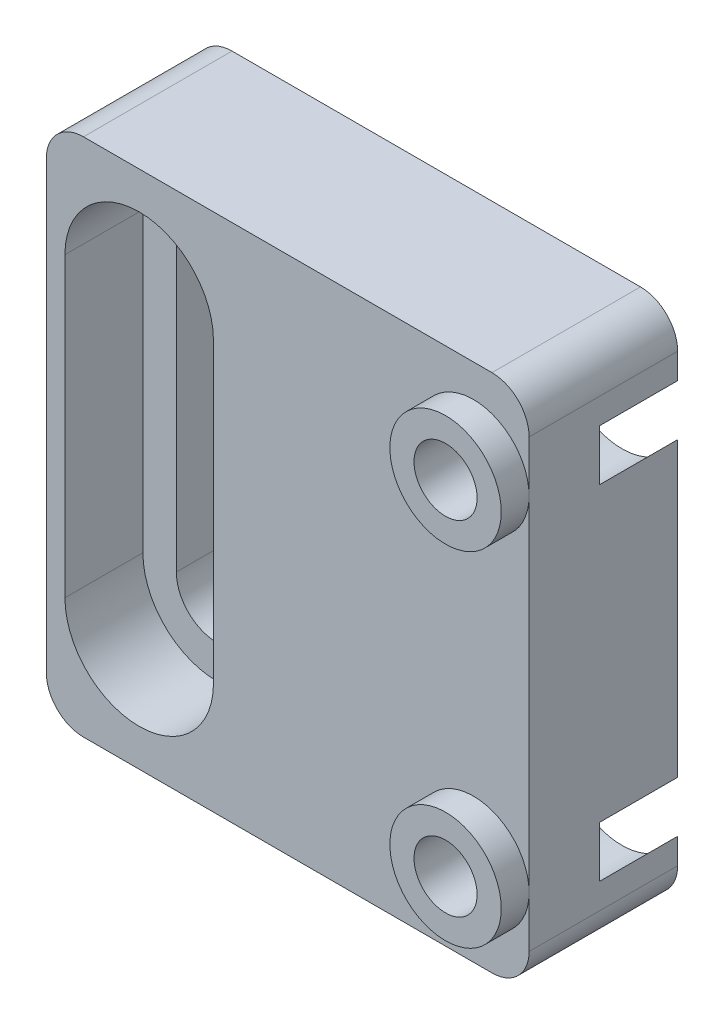
ISO-10303-21;
HEADER;
FILE_DESCRIPTION(('STEP AP214'),'2;1');
FILE_NAME('part.step','',(''),(''),'','','');
FILE_SCHEMA(('AUTOMOTIVE_DESIGN { 1 0 10303 214 1 1 1 1 }'));
ENDSEC;
DATA;
#1=APPLICATION_CONTEXT('core data for automotive mechanical design processes');
#2=APPLICATION_PROTOCOL_DEFINITION('international standard','automotive_design',2000,#1);
#3=PRODUCT_CONTEXT('',#1,'mechanical');
#4=PRODUCT('Part','Part','',(#3));
#5=PRODUCT_RELATED_PRODUCT_CATEGORY('part','',(#4));
#6=PRODUCT_DEFINITION_FORMATION('','',#4);
#7=PRODUCT_DEFINITION_CONTEXT('part definition',#1,'design');
#8=PRODUCT_DEFINITION('design','',#6,#7);
#9=PRODUCT_DEFINITION_SHAPE('','',#8);
#10=(LENGTH_UNIT() NAMED_UNIT(*) SI_UNIT(.MILLI.,.METRE.));
#11=(NAMED_UNIT(*) PLANE_ANGLE_UNIT() SI_UNIT($,.RADIAN.));
#12=(NAMED_UNIT(*) SI_UNIT($,.STERADIAN.) SOLID_ANGLE_UNIT());
#13=UNCERTAINTY_MEASURE_WITH_UNIT(LENGTH_MEASURE(1.E-05),#10,'distance_accuracy_value','');
#14=(GEOMETRIC_REPRESENTATION_CONTEXT(3) GLOBAL_UNCERTAINTY_ASSIGNED_CONTEXT((#13)) GLOBAL_UNIT_ASSIGNED_CONTEXT((#10,
#11,#12)) REPRESENTATION_CONTEXT('',''));
#15=CARTESIAN_POINT('',(0.,0.,0.));
#16=DIRECTION('',(0.,0.,1.));
#17=DIRECTION('',(1.,0.,0.));
#18=AXIS2_PLACEMENT_3D('',#15,#16,#17);
#19=CARTESIAN_POINT('',(0.,0.,8.));
#20=DIRECTION('',(0.,0.,1.));
#21=DIRECTION('',(1.,0.,0.));
#22=AXIS2_PLACEMENT_3D('',#19,#20,#21);
#23=PLANE('',#22);
#24=CARTESIAN_POINT('',(-3.00000000000001,8.,8.));
#25=DIRECTION('',(0.,0.,1.));
#26=DIRECTION('',(1.,0.,0.));
#27=AXIS2_PLACEMENT_3D('',#24,#25,#26);
#28=CIRCLE('',#27,4.);
#29=CARTESIAN_POINT('',(0.999999999999994,8.,8.));
#30=VERTEX_POINT('',#29);
#31=CARTESIAN_POINT('',(-7.,8.,8.));
#32=VERTEX_POINT('',#31);
#33=EDGE_CURVE('E321',#30,#32,#28,.T.);
#34=ORIENTED_EDGE('',*,*,#33,.F.);
#35=DIRECTION('',(0.,1.,0.));
#36=VECTOR('',#35,1.);
#37=CARTESIAN_POINT('',(0.999999999999994,8.,8.));
#38=LINE('',#37,#36);
#39=CARTESIAN_POINT('',(0.999999999999999,-8.,8.));
#40=VERTEX_POINT('',#39);
#41=EDGE_CURVE('E311',#40,#30,#38,.T.);
#42=ORIENTED_EDGE('',*,*,#41,.F.);
#43=CARTESIAN_POINT('',(-3.,-8.,8.));
#44=DIRECTION('',(0.,0.,1.));
#45=DIRECTION('',(1.,0.,0.));
#46=AXIS2_PLACEMENT_3D('',#43,#44,#45);
#47=CIRCLE('',#46,4.);
#48=CARTESIAN_POINT('',(-7.,-8.,8.));
#49=VERTEX_POINT('',#48);
#50=EDGE_CURVE('E315',#49,#40,#47,.T.);
#51=ORIENTED_EDGE('',*,*,#50,.F.);
#52=DIRECTION('',(0.,-1.,0.));
#53=VECTOR('',#52,1.);
#54=CARTESIAN_POINT('',(-7.,8.,8.));
#55=LINE('',#54,#53);
#56=EDGE_CURVE('E318',#32,#49,#55,.T.);
#57=ORIENTED_EDGE('',*,*,#56,.F.);
#58=EDGE_LOOP('',(#34,#42,#51,#57));
#59=FACE_BOUND('',#58,.T.);
#60=DIRECTION('',(0.,-1.,0.));
#61=VECTOR('',#60,1.);
#62=CARTESIAN_POINT('',(-8.,14.,8.));
#63=LINE('',#62,#61);
#64=CARTESIAN_POINT('',(-8.,12.,8.));
#65=VERTEX_POINT('',#64);
#66=CARTESIAN_POINT('',(-8.,-12.,8.));
#67=VERTEX_POINT('',#66);
#68=EDGE_CURVE('E212',#65,#67,#63,.T.);
#69=ORIENTED_EDGE('',*,*,#68,.T.);
#70=CARTESIAN_POINT('',(-6.,-12.,8.));
#71=DIRECTION('',(0.,0.,1.));
#72=DIRECTION('',(1.,0.,0.));
#73=AXIS2_PLACEMENT_3D('',#70,#71,#72);
#74=CIRCLE('',#73,2.);
#75=CARTESIAN_POINT('',(-6.,-14.,8.));
#76=VERTEX_POINT('',#75);
#77=EDGE_CURVE('E243',#67,#76,#74,.T.);
#78=ORIENTED_EDGE('',*,*,#77,.T.);
#79=DIRECTION('',(1.,0.,0.));
#80=VECTOR('',#79,1.);
#81=CARTESIAN_POINT('',(-8.,-14.,8.));
#82=LINE('',#81,#80);
#83=CARTESIAN_POINT('',(16.,-14.,8.));
#84=VERTEX_POINT('',#83);
#85=EDGE_CURVE('E193',#76,#84,#82,.T.);
#86=ORIENTED_EDGE('',*,*,#85,.T.);
#87=CARTESIAN_POINT('',(16.,-12.,8.));
#88=DIRECTION('',(0.,0.,1.));
#89=DIRECTION('',(1.,0.,0.));
#90=AXIS2_PLACEMENT_3D('',#87,#88,#89);
#91=CIRCLE('',#90,2.);
#92=CARTESIAN_POINT('',(18.,-12.,8.));
#93=VERTEX_POINT('',#92);
#94=EDGE_CURVE('E48',#84,#93,#91,.T.);
#95=ORIENTED_EDGE('',*,*,#94,.T.);
#96=DIRECTION('',(0.,1.,0.));
#97=VECTOR('',#96,1.);
#98=CARTESIAN_POINT('',(18.,14.,8.));
#99=LINE('',#98,#97);
#100=CARTESIAN_POINT('',(18.,-9.25,8.));
#101=VERTEX_POINT('',#100);
#102=EDGE_CURVE('E177',#93,#101,#99,.T.);
#103=ORIENTED_EDGE('',*,*,#102,.T.);
#104=CARTESIAN_POINT('',(15.,-9.25,8.));
#105=DIRECTION('',(0.,0.,1.));
#106=DIRECTION('',(1.,0.,0.));
#107=AXIS2_PLACEMENT_3D('',#104,#105,#106);
#108=CIRCLE('',#107,3.);
#109=EDGE_CURVE('E182',#101,#101,#108,.T.);
#110=ORIENTED_EDGE('',*,*,#109,.F.);
#111=CARTESIAN_POINT('',(18.,9.25,8.));
#112=VERTEX_POINT('',#111);
#113=EDGE_CURVE('E186',#101,#112,#99,.T.);
#114=ORIENTED_EDGE('',*,*,#113,.T.);
#115=CARTESIAN_POINT('',(15.,9.25,8.));
#116=DIRECTION('',(0.,0.,1.));
#117=DIRECTION('',(1.,0.,0.));
#118=AXIS2_PLACEMENT_3D('',#115,#116,#117);
#119=CIRCLE('',#118,3.);
#120=EDGE_CURVE('E254',#112,#112,#119,.T.);
#121=ORIENTED_EDGE('',*,*,#120,.F.);
#122=CARTESIAN_POINT('',(18.,12.,8.));
#123=VERTEX_POINT('',#122);
#124=EDGE_CURVE('E188',#112,#123,#99,.T.);
#125=ORIENTED_EDGE('',*,*,#124,.T.);
#126=CARTESIAN_POINT('',(16.,12.,8.));
#127=DIRECTION('',(0.,0.,1.));
#128=DIRECTION('',(1.,0.,0.));
#129=AXIS2_PLACEMENT_3D('',#126,#127,#128);
#130=CIRCLE('',#129,2.);
#131=CARTESIAN_POINT('',(16.,14.,8.));
#132=VERTEX_POINT('',#131);
#133=EDGE_CURVE('E238',#123,#132,#130,.T.);
#134=ORIENTED_EDGE('',*,*,#133,.T.);
#135=DIRECTION('',(-1.,0.,0.));
#136=VECTOR('',#135,1.);
#137=CARTESIAN_POINT('',(-8.,14.,8.));
#138=LINE('',#137,#136);
#139=CARTESIAN_POINT('',(-6.,14.,8.));
#140=VERTEX_POINT('',#139);
#141=EDGE_CURVE('E185',#132,#140,#138,.T.);
#142=ORIENTED_EDGE('',*,*,#141,.T.);
#143=CARTESIAN_POINT('',(-6.,12.,8.));
#144=DIRECTION('',(0.,0.,1.));
#145=DIRECTION('',(1.,0.,0.));
#146=AXIS2_PLACEMENT_3D('',#143,#144,#145);
#147=CIRCLE('',#146,2.);
#148=EDGE_CURVE('E241',#140,#65,#147,.T.);
#149=ORIENTED_EDGE('',*,*,#148,.T.);
#150=EDGE_LOOP('',(#69,#78,#86,#95,#103,#110,#114,#121,#125,#134,#142,#149));
#151=FACE_BOUND('',#150,.T.);
#152=ADVANCED_FACE('F33',(#59,#151),#23,.T.);
#153=CARTESIAN_POINT('',(-3.,8.,0.));
#154=DIRECTION('',(0.,0.,1.));
#155=DIRECTION('',(1.,0.,0.));
#156=AXIS2_PLACEMENT_3D('',#153,#154,#155);
#157=CYLINDRICAL_SURFACE('',#156,2.2);
#158=CARTESIAN_POINT('',(-3.,8.,3.8));
#159=DIRECTION('',(0.,0.,1.));
#160=DIRECTION('',(1.,0.,0.));
#161=AXIS2_PLACEMENT_3D('',#158,#159,#160);
#162=CIRCLE('',#161,2.2);
#163=CARTESIAN_POINT('',(-5.2,8.,3.8));
#164=VERTEX_POINT('',#163);
#165=CARTESIAN_POINT('',(-0.800000000000004,8.,3.8));
#166=VERTEX_POINT('',#165);
#167=EDGE_CURVE('E295',#164,#166,#162,.F.);
#168=ORIENTED_EDGE('',*,*,#167,.F.);
#169=DIRECTION('',(0.,0.,1.));
#170=VECTOR('',#169,1.);
#171=CARTESIAN_POINT('',(-5.2,8.,0.));
#172=LINE('',#171,#170);
#173=CARTESIAN_POINT('',(-5.2,8.,0.));
#174=VERTEX_POINT('',#173);
#175=EDGE_CURVE('E272',#174,#164,#172,.T.);
#176=ORIENTED_EDGE('',*,*,#175,.F.);
#177=CARTESIAN_POINT('',(-3.,8.,0.));
#178=DIRECTION('',(0.,0.,1.));
#179=DIRECTION('',(1.,0.,0.));
#180=AXIS2_PLACEMENT_3D('',#177,#178,#179);
#181=CIRCLE('',#180,2.2);
#182=CARTESIAN_POINT('',(-0.800000000000004,8.,0.));
#183=VERTEX_POINT('',#182);
#184=EDGE_CURVE('E292',#183,#174,#181,.T.);
#185=ORIENTED_EDGE('',*,*,#184,.F.);
#186=DIRECTION('',(0.,0.,1.));
#187=VECTOR('',#186,1.);
#188=CARTESIAN_POINT('',(-0.800000000000004,8.,0.));
#189=LINE('',#188,#187);
#190=EDGE_CURVE('E203',#183,#166,#189,.T.);
#191=ORIENTED_EDGE('',*,*,#190,.T.);
#192=EDGE_LOOP('',(#168,#176,#185,#191));
#193=FACE_BOUND('',#192,.T.);
#194=ADVANCED_FACE('F392',(#193),#157,.F.);
#195=CARTESIAN_POINT('',(-0.800000000000004,8.,0.));
#196=DIRECTION('',(1.,0.,0.));
#197=DIRECTION('',(0.,1.,0.));
#198=AXIS2_PLACEMENT_3D('',#195,#196,#197);
#199=PLANE('',#198);
#200=DIRECTION('',(0.,-1.,0.));
#201=VECTOR('',#200,1.);
#202=CARTESIAN_POINT('',(-0.800000000000004,8.,3.8));
#203=LINE('',#202,#201);
#204=CARTESIAN_POINT('',(-0.800000000000005,-8.,3.8));
#205=VERTEX_POINT('',#204);
#206=EDGE_CURVE('E297',#166,#205,#203,.T.);
#207=ORIENTED_EDGE('',*,*,#206,.F.);
#208=ORIENTED_EDGE('',*,*,#190,.F.);
#209=DIRECTION('',(0.,1.,0.));
#210=VECTOR('',#209,1.);
#211=CARTESIAN_POINT('',(-0.800000000000004,8.,0.));
#212=LINE('',#211,#210);
#213=CARTESIAN_POINT('',(-0.800000000000005,-8.,0.));
#214=VERTEX_POINT('',#213);
#215=EDGE_CURVE('E276',#214,#183,#212,.T.);
#216=ORIENTED_EDGE('',*,*,#215,.F.);
#217=DIRECTION('',(0.,0.,1.));
#218=VECTOR('',#217,1.);
#219=CARTESIAN_POINT('',(-0.800000000000005,-8.,0.));
#220=LINE('',#219,#218);
#221=EDGE_CURVE('E279',#214,#205,#220,.T.);
#222=ORIENTED_EDGE('',*,*,#221,.T.);
#223=EDGE_LOOP('',(#207,#208,#216,#222));
#224=FACE_BOUND('',#223,.T.);
#225=ADVANCED_FACE('F398',(#224),#199,.F.);
#226=CARTESIAN_POINT('',(-3.,-8.,0.));
#227=DIRECTION('',(0.,0.,1.));
#228=DIRECTION('',(1.,0.,0.));
#229=AXIS2_PLACEMENT_3D('',#226,#227,#228);
#230=CYLINDRICAL_SURFACE('',#229,2.2);
#231=CARTESIAN_POINT('',(-3.,-8.,3.8));
#232=DIRECTION('',(0.,0.,1.));
#233=DIRECTION('',(1.,0.,0.));
#234=AXIS2_PLACEMENT_3D('',#231,#232,#233);
#235=CIRCLE('',#234,2.2);
#236=CARTESIAN_POINT('',(-5.2,-8.,3.8));
#237=VERTEX_POINT('',#236);
#238=EDGE_CURVE('E299',#205,#237,#235,.F.);
#239=ORIENTED_EDGE('',*,*,#238,.F.);
#240=ORIENTED_EDGE('',*,*,#221,.F.);
#241=CARTESIAN_POINT('',(-3.,-8.,0.));
#242=DIRECTION('',(0.,0.,1.));
#243=DIRECTION('',(1.,0.,0.));
#244=AXIS2_PLACEMENT_3D('',#241,#242,#243);
#245=CIRCLE('',#244,2.2);
#246=CARTESIAN_POINT('',(-5.2,-8.,0.));
#247=VERTEX_POINT('',#246);
#248=EDGE_CURVE('E286',#247,#214,#245,.T.);
#249=ORIENTED_EDGE('',*,*,#248,.F.);
#250=DIRECTION('',(0.,0.,1.));
#251=VECTOR('',#250,1.);
#252=CARTESIAN_POINT('',(-5.2,-8.,0.));
#253=LINE('',#252,#251);
#254=EDGE_CURVE('E275',#247,#237,#253,.T.);
#255=ORIENTED_EDGE('',*,*,#254,.T.);
#256=EDGE_LOOP('',(#239,#240,#249,#255));
#257=FACE_BOUND('',#256,.T.);
#258=ADVANCED_FACE('F489',(#257),#230,.F.);
#259=CARTESIAN_POINT('',(-5.2,8.,0.));
#260=DIRECTION('',(-1.,0.,0.));
#261=DIRECTION('',(0.,-1.,0.));
#262=AXIS2_PLACEMENT_3D('',#259,#260,#261);
#263=PLANE('',#262);
#264=DIRECTION('',(0.,1.,0.));
#265=VECTOR('',#264,1.);
#266=CARTESIAN_POINT('',(-5.2,8.,3.8));
#267=LINE('',#266,#265);
#268=EDGE_CURVE('E198',#237,#164,#267,.T.);
#269=ORIENTED_EDGE('',*,*,#268,.F.);
#270=ORIENTED_EDGE('',*,*,#254,.F.);
#271=DIRECTION('',(0.,-1.,0.));
#272=VECTOR('',#271,1.);
#273=CARTESIAN_POINT('',(-5.2,8.,0.));
#274=LINE('',#273,#272);
#275=EDGE_CURVE('E289',#174,#247,#274,.T.);
#276=ORIENTED_EDGE('',*,*,#275,.F.);
#277=ORIENTED_EDGE('',*,*,#175,.T.);
#278=EDGE_LOOP('',(#269,#270,#276,#277));
#279=FACE_BOUND('',#278,.T.);
#280=ADVANCED_FACE('F418',(#279),#263,.F.);
#281=CARTESIAN_POINT('',(-8.,14.,8.));
#282=DIRECTION('',(1.,0.,0.));
#283=DIRECTION('',(0.,1.,0.));
#284=AXIS2_PLACEMENT_3D('',#281,#282,#283);
#285=PLANE('',#284);
#286=DIRECTION('',(0.,-1.,0.));
#287=VECTOR('',#286,1.);
#288=CARTESIAN_POINT('',(-8.,14.,0.));
#289=LINE('',#288,#287);
#290=CARTESIAN_POINT('',(-8.,12.,0.));
#291=VERTEX_POINT('',#290);
#292=CARTESIAN_POINT('',(-8.,-12.,0.));
#293=VERTEX_POINT('',#292);
#294=EDGE_CURVE('E199',#291,#293,#289,.T.);
#295=ORIENTED_EDGE('',*,*,#294,.T.);
#296=DIRECTION('',(0.,0.,-1.));
#297=VECTOR('',#296,1.);
#298=CARTESIAN_POINT('',(-8.,-12.,8.));
#299=LINE('',#298,#297);
#300=EDGE_CURVE('E236',#293,#67,#299,.F.);
#301=ORIENTED_EDGE('',*,*,#300,.T.);
#302=ORIENTED_EDGE('',*,*,#68,.F.);
#303=DIRECTION('',(0.,0.,-1.));
#304=VECTOR('',#303,1.);
#305=CARTESIAN_POINT('',(-8.,12.,8.));
#306=LINE('',#305,#304);
#307=EDGE_CURVE('E233',#65,#291,#306,.T.);
#308=ORIENTED_EDGE('',*,*,#307,.T.);
#309=EDGE_LOOP('',(#295,#301,#302,#308));
#310=FACE_BOUND('',#309,.T.);
#311=ADVANCED_FACE('F268',(#310),#285,.F.);
#312=CARTESIAN_POINT('',(-8.,-14.,8.));
#313=DIRECTION('',(0.,1.,0.));
#314=DIRECTION('',(-1.,0.,0.));
#315=AXIS2_PLACEMENT_3D('',#312,#313,#314);
#316=PLANE('',#315);
#317=ORIENTED_EDGE('',*,*,#85,.F.);
#318=DIRECTION('',(0.,0.,-1.));
#319=VECTOR('',#318,1.);
#320=CARTESIAN_POINT('',(-6.,-14.,8.));
#321=LINE('',#320,#319);
#322=CARTESIAN_POINT('',(-6.,-14.,0.));
#323=VERTEX_POINT('',#322);
#324=EDGE_CURVE('E222',#76,#323,#321,.T.);
#325=ORIENTED_EDGE('',*,*,#324,.T.);
#326=DIRECTION('',(1.,0.,0.));
#327=VECTOR('',#326,1.);
#328=CARTESIAN_POINT('',(-8.,-14.,0.));
#329=LINE('',#328,#327);
#330=CARTESIAN_POINT('',(16.,-14.,0.));
#331=VERTEX_POINT('',#330);
#332=EDGE_CURVE('E202',#323,#331,#329,.T.);
#333=ORIENTED_EDGE('',*,*,#332,.T.);
#334=DIRECTION('',(0.,0.,-1.));
#335=VECTOR('',#334,1.);
#336=CARTESIAN_POINT('',(16.,-14.,8.));
#337=LINE('',#336,#335);
#338=EDGE_CURVE('E220',#331,#84,#337,.F.);
#339=ORIENTED_EDGE('',*,*,#338,.T.);
#340=EDGE_LOOP('',(#317,#325,#333,#339));
#341=FACE_BOUND('',#340,.T.);
#342=ADVANCED_FACE('F412',(#341),#316,.F.);
#343=CARTESIAN_POINT('',(18.,14.,8.));
#344=DIRECTION('',(-1.,0.,0.));
#345=DIRECTION('',(0.,0.,1.));
#346=AXIS2_PLACEMENT_3D('',#343,#344,#345);
#347=PLANE('',#346);
#348=ORIENTED_EDGE('',*,*,#102,.F.);
#349=DIRECTION('',(0.,0.,-1.));
#350=VECTOR('',#349,1.);
#351=CARTESIAN_POINT('',(18.,-12.,8.));
#352=LINE('',#351,#350);
#353=CARTESIAN_POINT('',(18.,-12.,0.));
#354=VERTEX_POINT('',#353);
#355=EDGE_CURVE('E11',#93,#354,#352,.T.);
#356=ORIENTED_EDGE('',*,*,#355,.T.);
#357=DIRECTION('',(0.,1.,0.));
#358=VECTOR('',#357,1.);
#359=CARTESIAN_POINT('',(18.,14.,0.));
#360=LINE('',#359,#358);
#361=CARTESIAN_POINT('',(18.,-10.6247727084868,0.));
#362=VERTEX_POINT('',#361);
#363=EDGE_CURVE('E207',#354,#362,#360,.T.);
#364=ORIENTED_EDGE('',*,*,#363,.T.);
#365=DIRECTION('',(0.,0.,-1.));
#366=VECTOR('',#365,1.);
#367=CARTESIAN_POINT('',(18.,-10.6247727084868,4.2));
#368=LINE('',#367,#366);
#369=CARTESIAN_POINT('',(18.,-10.6247727084868,4.2));
#370=VERTEX_POINT('',#369);
#371=EDGE_CURVE('E348',#362,#370,#368,.F.);
#372=ORIENTED_EDGE('',*,*,#371,.T.);
#373=DIRECTION('',(0.,-1.,0.));
#374=VECTOR('',#373,1.);
#375=CARTESIAN_POINT('',(18.,14.,4.2));
#376=LINE('',#375,#374);
#377=CARTESIAN_POINT('',(18.,-7.87522729151324,4.2));
#378=VERTEX_POINT('',#377);
#379=EDGE_CURVE('E351',#378,#370,#376,.T.);
#380=ORIENTED_EDGE('',*,*,#379,.F.);
#381=DIRECTION('',(0.,0.,-1.));
#382=VECTOR('',#381,1.);
#383=CARTESIAN_POINT('',(18.,-7.87522729151324,4.2));
#384=LINE('',#383,#382);
#385=CARTESIAN_POINT('',(18.,-7.87522729151324,0.));
#386=VERTEX_POINT('',#385);
#387=EDGE_CURVE('E343',#378,#386,#384,.T.);
#388=ORIENTED_EDGE('',*,*,#387,.T.);
#389=CARTESIAN_POINT('',(18.,7.87522729151324,0.));
#390=VERTEX_POINT('',#389);
#391=EDGE_CURVE('E210',#386,#390,#360,.T.);
#392=ORIENTED_EDGE('',*,*,#391,.T.);
#393=DIRECTION('',(0.,0.,-1.));
#394=VECTOR('',#393,1.);
#395=CARTESIAN_POINT('',(18.,7.87522729151324,4.2));
#396=LINE('',#395,#394);
#397=CARTESIAN_POINT('',(18.,7.87522729151324,4.2));
#398=VERTEX_POINT('',#397);
#399=EDGE_CURVE('E335',#390,#398,#396,.F.);
#400=ORIENTED_EDGE('',*,*,#399,.T.);
#401=DIRECTION('',(0.,-1.,0.));
#402=VECTOR('',#401,1.);
#403=CARTESIAN_POINT('',(18.,14.,4.2));
#404=LINE('',#403,#402);
#405=CARTESIAN_POINT('',(18.,10.6247727084868,4.2));
#406=VERTEX_POINT('',#405);
#407=EDGE_CURVE('E338',#406,#398,#404,.T.);
#408=ORIENTED_EDGE('',*,*,#407,.F.);
#409=DIRECTION('',(0.,0.,-1.));
#410=VECTOR('',#409,1.);
#411=CARTESIAN_POINT('',(18.,10.6247727084868,4.2));
#412=LINE('',#411,#410);
#413=CARTESIAN_POINT('',(18.,10.6247727084868,0.));
#414=VERTEX_POINT('',#413);
#415=EDGE_CURVE('E323',#406,#414,#412,.T.);
#416=ORIENTED_EDGE('',*,*,#415,.T.);
#417=CARTESIAN_POINT('',(18.,12.,0.));
#418=VERTEX_POINT('',#417);
#419=EDGE_CURVE('E206',#414,#418,#360,.T.);
#420=ORIENTED_EDGE('',*,*,#419,.T.);
#421=DIRECTION('',(0.,0.,-1.));
#422=VECTOR('',#421,1.);
#423=CARTESIAN_POINT('',(18.,12.,8.));
#424=LINE('',#423,#422);
#425=EDGE_CURVE('E41',#418,#123,#424,.F.);
#426=ORIENTED_EDGE('',*,*,#425,.T.);
#427=ORIENTED_EDGE('',*,*,#124,.F.);
#428=ORIENTED_EDGE('',*,*,#113,.F.);
#429=EDGE_LOOP('',(#348,#356,#364,#372,#380,#388,#392,#400,#408,#416,#420,#426,#427,#428));
#430=FACE_BOUND('',#429,.T.);
#431=ADVANCED_FACE('F190',(#430),#347,.F.);
#432=CARTESIAN_POINT('',(-8.,14.,8.));
#433=DIRECTION('',(0.,-1.,0.));
#434=DIRECTION('',(1.,0.,0.));
#435=AXIS2_PLACEMENT_3D('',#432,#433,#434);
#436=PLANE('',#435);
#437=DIRECTION('',(-1.,0.,0.));
#438=VECTOR('',#437,1.);
#439=CARTESIAN_POINT('',(-8.,14.,0.));
#440=LINE('',#439,#438);
#441=CARTESIAN_POINT('',(16.,14.,0.));
#442=VERTEX_POINT('',#441);
#443=CARTESIAN_POINT('',(-6.,14.,0.));
#444=VERTEX_POINT('',#443);
#445=EDGE_CURVE('E209',#442,#444,#440,.T.);
#446=ORIENTED_EDGE('',*,*,#445,.T.);
#447=DIRECTION('',(0.,0.,-1.));
#448=VECTOR('',#447,1.);
#449=CARTESIAN_POINT('',(-6.,14.,8.));
#450=LINE('',#449,#448);
#451=EDGE_CURVE('E56',#444,#140,#450,.F.);
#452=ORIENTED_EDGE('',*,*,#451,.T.);
#453=ORIENTED_EDGE('',*,*,#141,.F.);
#454=DIRECTION('',(0.,0.,-1.));
#455=VECTOR('',#454,1.);
#456=CARTESIAN_POINT('',(16.,14.,8.));
#457=LINE('',#456,#455);
#458=EDGE_CURVE('E245',#132,#442,#457,.T.);
#459=ORIENTED_EDGE('',*,*,#458,.T.);
#460=EDGE_LOOP('',(#446,#452,#453,#459));
#461=FACE_BOUND('',#460,.T.);
#462=ADVANCED_FACE('F257',(#461),#436,.F.);
#463=CARTESIAN_POINT('',(0.,0.,0.));
#464=DIRECTION('',(0.,0.,1.));
#465=DIRECTION('',(1.,0.,0.));
#466=AXIS2_PLACEMENT_3D('',#463,#464,#465);
#467=PLANE('',#466);
#468=ORIENTED_EDGE('',*,*,#215,.T.);
#469=ORIENTED_EDGE('',*,*,#184,.T.);
#470=ORIENTED_EDGE('',*,*,#275,.T.);
#471=ORIENTED_EDGE('',*,*,#248,.T.);
#472=EDGE_LOOP('',(#468,#469,#470,#471));
#473=FACE_BOUND('',#472,.T.);
#474=ORIENTED_EDGE('',*,*,#332,.F.);
#475=CARTESIAN_POINT('',(-6.,-12.,0.));
#476=DIRECTION('',(0.,0.,1.));
#477=DIRECTION('',(1.,0.,0.));
#478=AXIS2_PLACEMENT_3D('',#475,#476,#477);
#479=CIRCLE('',#478,2.);
#480=EDGE_CURVE('E231',#323,#293,#479,.F.);
#481=ORIENTED_EDGE('',*,*,#480,.T.);
#482=ORIENTED_EDGE('',*,*,#294,.F.);
#483=CARTESIAN_POINT('',(-6.,12.,0.));
#484=DIRECTION('',(0.,0.,1.));
#485=DIRECTION('',(1.,0.,0.));
#486=AXIS2_PLACEMENT_3D('',#483,#484,#485);
#487=CIRCLE('',#486,2.);
#488=EDGE_CURVE('E229',#291,#444,#487,.F.);
#489=ORIENTED_EDGE('',*,*,#488,.T.);
#490=ORIENTED_EDGE('',*,*,#445,.F.);
#491=CARTESIAN_POINT('',(16.,12.,0.));
#492=DIRECTION('',(0.,0.,1.));
#493=DIRECTION('',(1.,0.,0.));
#494=AXIS2_PLACEMENT_3D('',#491,#492,#493);
#495=CIRCLE('',#494,2.);
#496=EDGE_CURVE('E225',#442,#418,#495,.F.);
#497=ORIENTED_EDGE('',*,*,#496,.T.);
#498=ORIENTED_EDGE('',*,*,#419,.F.);
#499=CARTESIAN_POINT('',(15.,9.25,0.));
#500=DIRECTION('',(0.,0.,-1.));
#501=DIRECTION('',(-1.,0.,0.));
#502=AXIS2_PLACEMENT_3D('',#499,#500,#501);
#503=CIRCLE('',#502,3.3);
#504=EDGE_CURVE('E341',#390,#414,#503,.T.);
#505=ORIENTED_EDGE('',*,*,#504,.F.);
#506=ORIENTED_EDGE('',*,*,#391,.F.);
#507=CARTESIAN_POINT('',(15.,-9.25,0.));
#508=DIRECTION('',(0.,0.,-1.));
#509=DIRECTION('',(-1.,0.,0.));
#510=AXIS2_PLACEMENT_3D('',#507,#508,#509);
#511=CIRCLE('',#510,3.3);
#512=EDGE_CURVE('E354',#362,#386,#511,.T.);
#513=ORIENTED_EDGE('',*,*,#512,.F.);
#514=ORIENTED_EDGE('',*,*,#363,.F.);
#515=CARTESIAN_POINT('',(16.,-12.,0.));
#516=DIRECTION('',(0.,0.,1.));
#517=DIRECTION('',(1.,0.,0.));
#518=AXIS2_PLACEMENT_3D('',#515,#516,#517);
#519=CIRCLE('',#518,2.);
#520=EDGE_CURVE('E227',#354,#331,#519,.F.);
#521=ORIENTED_EDGE('',*,*,#520,.T.);
#522=EDGE_LOOP('',(#474,#481,#482,#489,#490,#497,#498,#505,#506,#513,#514,#521));
#523=FACE_BOUND('',#522,.T.);
#524=ADVANCED_FACE('F260',(#473,#523),#467,.F.);
#525=CARTESIAN_POINT('',(-3.00000000000001,8.,3.8));
#526=DIRECTION('',(0.,0.,1.));
#527=DIRECTION('',(1.,0.,0.));
#528=AXIS2_PLACEMENT_3D('',#525,#526,#527);
#529=PLANE('',#528);
#530=CARTESIAN_POINT('',(-3.00000000000001,8.,3.8));
#531=DIRECTION('',(0.,0.,1.));
#532=DIRECTION('',(1.,0.,0.));
#533=AXIS2_PLACEMENT_3D('',#530,#531,#532);
#534=CIRCLE('',#533,4.);
#535=CARTESIAN_POINT('',(0.999999999999994,8.,3.8));
#536=VERTEX_POINT('',#535);
#537=CARTESIAN_POINT('',(-7.,8.,3.8));
#538=VERTEX_POINT('',#537);
#539=EDGE_CURVE('E314',#536,#538,#534,.T.);
#540=ORIENTED_EDGE('',*,*,#539,.T.);
#541=DIRECTION('',(0.,-1.,0.));
#542=VECTOR('',#541,1.);
#543=CARTESIAN_POINT('',(-7.,8.,3.8));
#544=LINE('',#543,#542);
#545=CARTESIAN_POINT('',(-7.,-8.,3.8));
#546=VERTEX_POINT('',#545);
#547=EDGE_CURVE('E329',#538,#546,#544,.T.);
#548=ORIENTED_EDGE('',*,*,#547,.T.);
#549=CARTESIAN_POINT('',(-3.,-8.,3.8));
#550=DIRECTION('',(0.,0.,1.));
#551=DIRECTION('',(1.,0.,0.));
#552=AXIS2_PLACEMENT_3D('',#549,#550,#551);
#553=CIRCLE('',#552,4.);
#554=CARTESIAN_POINT('',(0.999999999999999,-8.,3.8));
#555=VERTEX_POINT('',#554);
#556=EDGE_CURVE('E326',#546,#555,#553,.T.);
#557=ORIENTED_EDGE('',*,*,#556,.T.);
#558=DIRECTION('',(0.,1.,0.));
#559=VECTOR('',#558,1.);
#560=CARTESIAN_POINT('',(0.999999999999994,8.,3.8));
#561=LINE('',#560,#559);
#562=EDGE_CURVE('E306',#555,#536,#561,.T.);
#563=ORIENTED_EDGE('',*,*,#562,.T.);
#564=EDGE_LOOP('',(#540,#548,#557,#563));
#565=FACE_BOUND('',#564,.T.);
#566=ORIENTED_EDGE('',*,*,#167,.T.);
#567=ORIENTED_EDGE('',*,*,#206,.T.);
#568=ORIENTED_EDGE('',*,*,#238,.T.);
#569=ORIENTED_EDGE('',*,*,#268,.T.);
#570=EDGE_LOOP('',(#566,#567,#568,#569));
#571=FACE_BOUND('',#570,.T.);
#572=ADVANCED_FACE('F406',(#565,#571),#529,.T.);
#573=CARTESIAN_POINT('',(-3.00000000000001,8.,3.8));
#574=DIRECTION('',(0.,0.,1.));
#575=DIRECTION('',(1.,0.,0.));
#576=AXIS2_PLACEMENT_3D('',#573,#574,#575);
#577=CYLINDRICAL_SURFACE('',#576,4.);
#578=ORIENTED_EDGE('',*,*,#33,.T.);
#579=DIRECTION('',(0.,0.,1.));
#580=VECTOR('',#579,1.);
#581=CARTESIAN_POINT('',(-7.,8.,3.8));
#582=LINE('',#581,#580);
#583=EDGE_CURVE('E302',#538,#32,#582,.T.);
#584=ORIENTED_EDGE('',*,*,#583,.F.);
#585=ORIENTED_EDGE('',*,*,#539,.F.);
#586=DIRECTION('',(0.,0.,1.));
#587=VECTOR('',#586,1.);
#588=CARTESIAN_POINT('',(0.999999999999994,8.,3.8));
#589=LINE('',#588,#587);
#590=EDGE_CURVE('E301',#536,#30,#589,.T.);
#591=ORIENTED_EDGE('',*,*,#590,.T.);
#592=EDGE_LOOP('',(#578,#584,#585,#591));
#593=FACE_BOUND('',#592,.T.);
#594=ADVANCED_FACE('F471',(#593),#577,.F.);
#595=CARTESIAN_POINT('',(0.999999999999994,8.,3.8));
#596=DIRECTION('',(1.,0.,0.));
#597=DIRECTION('',(0.,1.,0.));
#598=AXIS2_PLACEMENT_3D('',#595,#596,#597);
#599=PLANE('',#598);
#600=ORIENTED_EDGE('',*,*,#41,.T.);
#601=ORIENTED_EDGE('',*,*,#590,.F.);
#602=ORIENTED_EDGE('',*,*,#562,.F.);
#603=DIRECTION('',(0.,0.,1.));
#604=VECTOR('',#603,1.);
#605=CARTESIAN_POINT('',(0.999999999999999,-8.,3.8));
#606=LINE('',#605,#604);
#607=EDGE_CURVE('E308',#555,#40,#606,.T.);
#608=ORIENTED_EDGE('',*,*,#607,.T.);
#609=EDGE_LOOP('',(#600,#601,#602,#608));
#610=FACE_BOUND('',#609,.T.);
#611=ADVANCED_FACE('F473',(#610),#599,.F.);
#612=CARTESIAN_POINT('',(-3.,-8.,3.8));
#613=DIRECTION('',(0.,0.,1.));
#614=DIRECTION('',(1.,0.,0.));
#615=AXIS2_PLACEMENT_3D('',#612,#613,#614);
#616=CYLINDRICAL_SURFACE('',#615,4.);
#617=ORIENTED_EDGE('',*,*,#50,.T.);
#618=ORIENTED_EDGE('',*,*,#607,.F.);
#619=ORIENTED_EDGE('',*,*,#556,.F.);
#620=DIRECTION('',(0.,0.,1.));
#621=VECTOR('',#620,1.);
#622=CARTESIAN_POINT('',(-7.,-8.,3.8));
#623=LINE('',#622,#621);
#624=EDGE_CURVE('E305',#546,#49,#623,.T.);
#625=ORIENTED_EDGE('',*,*,#624,.T.);
#626=EDGE_LOOP('',(#617,#618,#619,#625));
#627=FACE_BOUND('',#626,.T.);
#628=ADVANCED_FACE('F476',(#627),#616,.F.);
#629=CARTESIAN_POINT('',(-7.,8.,3.8));
#630=DIRECTION('',(-1.,0.,0.));
#631=DIRECTION('',(0.,-1.,0.));
#632=AXIS2_PLACEMENT_3D('',#629,#630,#631);
#633=PLANE('',#632);
#634=ORIENTED_EDGE('',*,*,#56,.T.);
#635=ORIENTED_EDGE('',*,*,#624,.F.);
#636=ORIENTED_EDGE('',*,*,#547,.F.);
#637=ORIENTED_EDGE('',*,*,#583,.T.);
#638=EDGE_LOOP('',(#634,#635,#636,#637));
#639=FACE_BOUND('',#638,.T.);
#640=ADVANCED_FACE('F463',(#639),#633,.F.);
#641=CARTESIAN_POINT('',(15.,9.25,4.2));
#642=DIRECTION('',(0.,0.,-1.));
#643=DIRECTION('',(-1.,0.,0.));
#644=AXIS2_PLACEMENT_3D('',#641,#642,#643);
#645=CYLINDRICAL_SURFACE('',#644,3.3);
#646=CARTESIAN_POINT('',(15.,9.25,4.2));
#647=DIRECTION('',(0.,0.,-1.));
#648=DIRECTION('',(-1.,0.,0.));
#649=AXIS2_PLACEMENT_3D('',#646,#647,#648);
#650=CIRCLE('',#649,3.3);
#651=EDGE_CURVE('E340',#398,#406,#650,.T.);
#652=ORIENTED_EDGE('',*,*,#651,.F.);
#653=ORIENTED_EDGE('',*,*,#399,.F.);
#654=ORIENTED_EDGE('',*,*,#504,.T.);
#655=ORIENTED_EDGE('',*,*,#415,.F.);
#656=EDGE_LOOP('',(#652,#653,#654,#655));
#657=FACE_BOUND('',#656,.T.);
#658=ADVANCED_FACE('F460',(#657),#645,.F.);
#659=CARTESIAN_POINT('',(15.,9.25,4.2));
#660=DIRECTION('',(0.,0.,-1.));
#661=DIRECTION('',(-1.,0.,0.));
#662=AXIS2_PLACEMENT_3D('',#659,#660,#661);
#663=PLANE('',#662);
#664=ORIENTED_EDGE('',*,*,#407,.T.);
#665=ORIENTED_EDGE('',*,*,#651,.T.);
#666=EDGE_LOOP('',(#664,#665));
#667=FACE_BOUND('',#666,.T.);
#668=ADVANCED_FACE('F453',(#667),#663,.T.);
#669=CARTESIAN_POINT('',(15.,-9.25,4.2));
#670=DIRECTION('',(0.,0.,-1.));
#671=DIRECTION('',(-1.,0.,0.));
#672=AXIS2_PLACEMENT_3D('',#669,#670,#671);
#673=CYLINDRICAL_SURFACE('',#672,3.3);
#674=CARTESIAN_POINT('',(15.,-9.25,4.2));
#675=DIRECTION('',(0.,0.,-1.));
#676=DIRECTION('',(-1.,0.,0.));
#677=AXIS2_PLACEMENT_3D('',#674,#675,#676);
#678=CIRCLE('',#677,3.3);
#679=EDGE_CURVE('E353',#370,#378,#678,.T.);
#680=ORIENTED_EDGE('',*,*,#679,.F.);
#681=ORIENTED_EDGE('',*,*,#371,.F.);
#682=ORIENTED_EDGE('',*,*,#512,.T.);
#683=ORIENTED_EDGE('',*,*,#387,.F.);
#684=EDGE_LOOP('',(#680,#681,#682,#683));
#685=FACE_BOUND('',#684,.T.);
#686=ADVANCED_FACE('F438',(#685),#673,.F.);
#687=CARTESIAN_POINT('',(15.,-9.25,4.2));
#688=DIRECTION('',(0.,0.,-1.));
#689=DIRECTION('',(-1.,0.,0.));
#690=AXIS2_PLACEMENT_3D('',#687,#688,#689);
#691=PLANE('',#690);
#692=ORIENTED_EDGE('',*,*,#379,.T.);
#693=ORIENTED_EDGE('',*,*,#679,.T.);
#694=EDGE_LOOP('',(#692,#693));
#695=FACE_BOUND('',#694,.T.);
#696=ADVANCED_FACE('F442',(#695),#691,.T.);
#697=CARTESIAN_POINT('',(15.,-9.25,9.5));
#698=DIRECTION('',(0.,0.,1.));
#699=DIRECTION('',(1.,0.,0.));
#700=AXIS2_PLACEMENT_3D('',#697,#698,#699);
#701=PLANE('',#700);
#702=CARTESIAN_POINT('',(15.,-9.25,9.5));
#703=DIRECTION('',(0.,0.,1.));
#704=DIRECTION('',(1.,0.,0.));
#705=AXIS2_PLACEMENT_3D('',#702,#703,#704);
#706=CIRCLE('',#705,3.);
#707=CARTESIAN_POINT('',(18.,-9.25,9.5));
#708=VERTEX_POINT('',#707);
#709=EDGE_CURVE('E356',#708,#708,#706,.T.);
#710=ORIENTED_EDGE('',*,*,#709,.T.);
#711=EDGE_LOOP('',(#710));
#712=FACE_BOUND('',#711,.T.);
#713=CARTESIAN_POINT('',(15.,-9.25,9.5));
#714=DIRECTION('',(0.,0.,1.));
#715=DIRECTION('',(1.,0.,0.));
#716=AXIS2_PLACEMENT_3D('',#713,#714,#715);
#717=CIRCLE('',#716,1.7);
#718=CARTESIAN_POINT('',(16.7,-9.25,9.5));
#719=VERTEX_POINT('',#718);
#720=EDGE_CURVE('E360',#719,#719,#717,.T.);
#721=ORIENTED_EDGE('',*,*,#720,.F.);
#722=EDGE_LOOP('',(#721));
#723=FACE_BOUND('',#722,.T.);
#724=ADVANCED_FACE('F444',(#712,#723),#701,.T.);
#725=CARTESIAN_POINT('',(15.,-9.25,9.5));
#726=DIRECTION('',(0.,0.,-1.));
#727=DIRECTION('',(-1.,0.,0.));
#728=AXIS2_PLACEMENT_3D('',#725,#726,#727);
#729=CYLINDRICAL_SURFACE('',#728,3.);
#730=ORIENTED_EDGE('',*,*,#709,.F.);
#731=EDGE_LOOP('',(#730));
#732=FACE_BOUND('',#731,.T.);
#733=ORIENTED_EDGE('',*,*,#109,.T.);
#734=EDGE_LOOP('',(#733));
#735=FACE_BOUND('',#734,.T.);
#736=ADVANCED_FACE('F450',(#732,#735),#729,.T.);
#737=CARTESIAN_POINT('',(15.,-9.25,5.2));
#738=DIRECTION('',(0.,0.,-1.));
#739=DIRECTION('',(-1.,0.,0.));
#740=AXIS2_PLACEMENT_3D('',#737,#738,#739);
#741=PLANE('',#740);
#742=CARTESIAN_POINT('',(15.,-9.25,5.2));
#743=DIRECTION('',(0.,0.,-1.));
#744=DIRECTION('',(-1.,0.,0.));
#745=AXIS2_PLACEMENT_3D('',#742,#743,#744);
#746=CIRCLE('',#745,1.7);
#747=CARTESIAN_POINT('',(13.3,-9.25,5.2));
#748=VERTEX_POINT('',#747);
#749=EDGE_CURVE('E217',#748,#748,#746,.F.);
#750=ORIENTED_EDGE('',*,*,#749,.T.);
#751=EDGE_LOOP('',(#750));
#752=FACE_BOUND('',#751,.T.);
#753=ADVANCED_FACE('F388',(#752),#741,.F.);
#754=CARTESIAN_POINT('',(15.,-9.25,0.));
#755=DIRECTION('',(0.,0.,1.));
#756=DIRECTION('',(1.,0.,0.));
#757=AXIS2_PLACEMENT_3D('',#754,#755,#756);
#758=CYLINDRICAL_SURFACE('',#757,1.7);
#759=ORIENTED_EDGE('',*,*,#749,.F.);
#760=EDGE_LOOP('',(#759));
#761=FACE_BOUND('',#760,.T.);
#762=ORIENTED_EDGE('',*,*,#720,.T.);
#763=EDGE_LOOP('',(#762));
#764=FACE_BOUND('',#763,.T.);
#765=ADVANCED_FACE('F378',(#761,#764),#758,.F.);
#766=CARTESIAN_POINT('',(15.,9.25,9.5));
#767=DIRECTION('',(0.,0.,1.));
#768=DIRECTION('',(1.,0.,0.));
#769=AXIS2_PLACEMENT_3D('',#766,#767,#768);
#770=PLANE('',#769);
#771=CARTESIAN_POINT('',(15.,9.25,9.5));
#772=DIRECTION('',(0.,0.,1.));
#773=DIRECTION('',(1.,0.,0.));
#774=AXIS2_PLACEMENT_3D('',#771,#772,#773);
#775=CIRCLE('',#774,3.);
#776=CARTESIAN_POINT('',(18.,9.25,9.5));
#777=VERTEX_POINT('',#776);
#778=EDGE_CURVE('E365',#777,#777,#775,.T.);
#779=ORIENTED_EDGE('',*,*,#778,.T.);
#780=EDGE_LOOP('',(#779));
#781=FACE_BOUND('',#780,.T.);
#782=CARTESIAN_POINT('',(15.,9.25,9.5));
#783=DIRECTION('',(0.,0.,1.));
#784=DIRECTION('',(1.,0.,0.));
#785=AXIS2_PLACEMENT_3D('',#782,#783,#784);
#786=CIRCLE('',#785,1.7);
#787=CARTESIAN_POINT('',(16.7,9.25,9.5));
#788=VERTEX_POINT('',#787);
#789=EDGE_CURVE('E367',#788,#788,#786,.T.);
#790=ORIENTED_EDGE('',*,*,#789,.F.);
#791=EDGE_LOOP('',(#790));
#792=FACE_BOUND('',#791,.T.);
#793=ADVANCED_FACE('F375',(#781,#792),#770,.T.);
#794=CARTESIAN_POINT('',(15.,9.25,9.5));
#795=DIRECTION('',(0.,0.,-1.));
#796=DIRECTION('',(-1.,0.,0.));
#797=AXIS2_PLACEMENT_3D('',#794,#795,#796);
#798=CYLINDRICAL_SURFACE('',#797,3.);
#799=ORIENTED_EDGE('',*,*,#778,.F.);
#800=EDGE_LOOP('',(#799));
#801=FACE_BOUND('',#800,.T.);
#802=ORIENTED_EDGE('',*,*,#120,.T.);
#803=EDGE_LOOP('',(#802));
#804=FACE_BOUND('',#803,.T.);
#805=ADVANCED_FACE('F377',(#801,#804),#798,.T.);
#806=CARTESIAN_POINT('',(15.,9.25,5.2));
#807=DIRECTION('',(0.,0.,-1.));
#808=DIRECTION('',(-1.,0.,0.));
#809=AXIS2_PLACEMENT_3D('',#806,#807,#808);
#810=PLANE('',#809);
#811=CARTESIAN_POINT('',(15.,9.25,5.2));
#812=DIRECTION('',(0.,0.,-1.));
#813=DIRECTION('',(-1.,0.,0.));
#814=AXIS2_PLACEMENT_3D('',#811,#812,#813);
#815=CIRCLE('',#814,1.7);
#816=CARTESIAN_POINT('',(13.3,9.25,5.2));
#817=VERTEX_POINT('',#816);
#818=EDGE_CURVE('E214',#817,#817,#815,.F.);
#819=ORIENTED_EDGE('',*,*,#818,.T.);
#820=EDGE_LOOP('',(#819));
#821=FACE_BOUND('',#820,.T.);
#822=ADVANCED_FACE('F385',(#821),#810,.F.);
#823=CARTESIAN_POINT('',(15.,9.25,0.));
#824=DIRECTION('',(0.,0.,1.));
#825=DIRECTION('',(1.,0.,0.));
#826=AXIS2_PLACEMENT_3D('',#823,#824,#825);
#827=CYLINDRICAL_SURFACE('',#826,1.7);
#828=ORIENTED_EDGE('',*,*,#818,.F.);
#829=EDGE_LOOP('',(#828));
#830=FACE_BOUND('',#829,.T.);
#831=ORIENTED_EDGE('',*,*,#789,.T.);
#832=EDGE_LOOP('',(#831));
#833=FACE_BOUND('',#832,.T.);
#834=ADVANCED_FACE('F373',(#830,#833),#827,.F.);
#835=CARTESIAN_POINT('',(-6.,-12.,8.));
#836=DIRECTION('',(0.,0.,-1.));
#837=DIRECTION('',(-1.,0.,0.));
#838=AXIS2_PLACEMENT_3D('',#835,#836,#837);
#839=CYLINDRICAL_SURFACE('',#838,2.);
#840=ORIENTED_EDGE('',*,*,#77,.F.);
#841=ORIENTED_EDGE('',*,*,#300,.F.);
#842=ORIENTED_EDGE('',*,*,#480,.F.);
#843=ORIENTED_EDGE('',*,*,#324,.F.);
#844=EDGE_LOOP('',(#840,#841,#842,#843));
#845=FACE_BOUND('',#844,.T.);
#846=ADVANCED_FACE('F419',(#845),#839,.T.);
#847=CARTESIAN_POINT('',(-6.,12.,8.));
#848=DIRECTION('',(0.,0.,-1.));
#849=DIRECTION('',(-1.,0.,0.));
#850=AXIS2_PLACEMENT_3D('',#847,#848,#849);
#851=CYLINDRICAL_SURFACE('',#850,2.);
#852=ORIENTED_EDGE('',*,*,#148,.F.);
#853=ORIENTED_EDGE('',*,*,#451,.F.);
#854=ORIENTED_EDGE('',*,*,#488,.F.);
#855=ORIENTED_EDGE('',*,*,#307,.F.);
#856=EDGE_LOOP('',(#852,#853,#854,#855));
#857=FACE_BOUND('',#856,.T.);
#858=ADVANCED_FACE('F265',(#857),#851,.T.);
#859=CARTESIAN_POINT('',(16.,-12.,8.));
#860=DIRECTION('',(0.,0.,-1.));
#861=DIRECTION('',(-1.,0.,0.));
#862=AXIS2_PLACEMENT_3D('',#859,#860,#861);
#863=CYLINDRICAL_SURFACE('',#862,2.);
#864=ORIENTED_EDGE('',*,*,#94,.F.);
#865=ORIENTED_EDGE('',*,*,#338,.F.);
#866=ORIENTED_EDGE('',*,*,#520,.F.);
#867=ORIENTED_EDGE('',*,*,#355,.F.);
#868=EDGE_LOOP('',(#864,#865,#866,#867));
#869=FACE_BOUND('',#868,.T.);
#870=ADVANCED_FACE('F424',(#869),#863,.T.);
#871=CARTESIAN_POINT('',(16.,12.,8.));
#872=DIRECTION('',(0.,0.,-1.));
#873=DIRECTION('',(-1.,0.,0.));
#874=AXIS2_PLACEMENT_3D('',#871,#872,#873);
#875=CYLINDRICAL_SURFACE('',#874,2.);
#876=ORIENTED_EDGE('',*,*,#133,.F.);
#877=ORIENTED_EDGE('',*,*,#425,.F.);
#878=ORIENTED_EDGE('',*,*,#496,.F.);
#879=ORIENTED_EDGE('',*,*,#458,.F.);
#880=EDGE_LOOP('',(#876,#877,#878,#879));
#881=FACE_BOUND('',#880,.T.);
#882=ADVANCED_FACE('F35',(#881),#875,.T.);
#883=CLOSED_SHELL('',(#152,#194,#225,#258,#280,#311,#342,#431,#462,#524,#572,#594,#611,#628,
#640,#658,#668,#686,#696,#724,#736,#753,#765,#793,#805,#822,#834,#846,#858,#870,#882));
#884=MANIFOLD_SOLID_BREP('B2',#883);
#885=ADVANCED_BREP_SHAPE_REPRESENTATION('',(#18,#884),#14);
#886=SHAPE_DEFINITION_REPRESENTATION(#9,#885);
ENDSEC;
END-ISO-10303-21;
